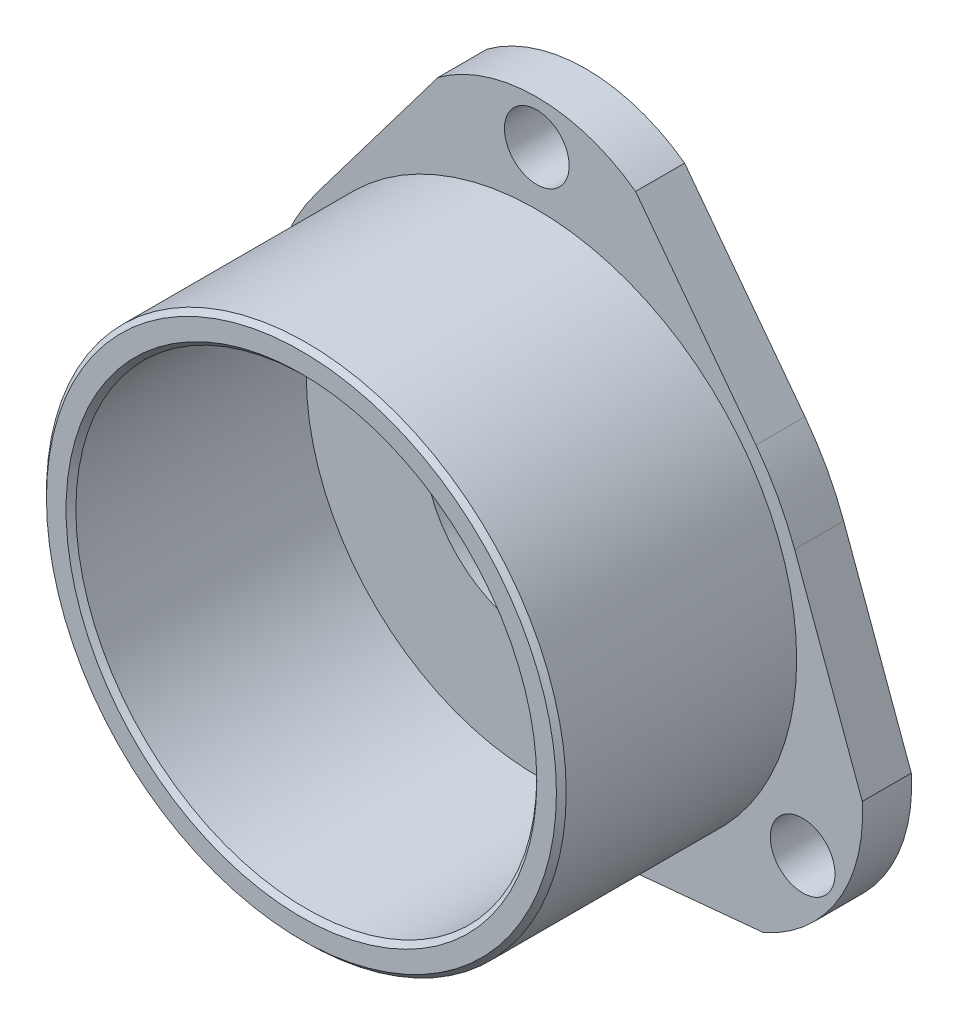
ISO-10303-21;
HEADER;
FILE_DESCRIPTION(('STEP AP214'),'2;1');
FILE_NAME('part.step','',(''),(''),'','','');
FILE_SCHEMA(('AUTOMOTIVE_DESIGN { 1 0 10303 214 1 1 1 1 }'));
ENDSEC;
DATA;
#1=APPLICATION_CONTEXT('core data for automotive mechanical design processes');
#2=APPLICATION_PROTOCOL_DEFINITION('international standard','automotive_design',2000,#1);
#3=PRODUCT_CONTEXT('',#1,'mechanical');
#4=PRODUCT('Part','Part','',(#3));
#5=PRODUCT_RELATED_PRODUCT_CATEGORY('part','',(#4));
#6=PRODUCT_DEFINITION_FORMATION('','',#4);
#7=PRODUCT_DEFINITION_CONTEXT('part definition',#1,'design');
#8=PRODUCT_DEFINITION('design','',#6,#7);
#9=PRODUCT_DEFINITION_SHAPE('','',#8);
#10=(LENGTH_UNIT() NAMED_UNIT(*) SI_UNIT(.MILLI.,.METRE.));
#11=(NAMED_UNIT(*) PLANE_ANGLE_UNIT() SI_UNIT($,.RADIAN.));
#12=(NAMED_UNIT(*) SI_UNIT($,.STERADIAN.) SOLID_ANGLE_UNIT());
#13=UNCERTAINTY_MEASURE_WITH_UNIT(LENGTH_MEASURE(1.E-05),#10,'distance_accuracy_value','');
#14=(GEOMETRIC_REPRESENTATION_CONTEXT(3) GLOBAL_UNCERTAINTY_ASSIGNED_CONTEXT((#13)) GLOBAL_UNIT_ASSIGNED_CONTEXT((#10,
#11,#12)) REPRESENTATION_CONTEXT('',''));
#15=CARTESIAN_POINT('',(0.,0.,0.));
#16=DIRECTION('',(0.,0.,1.));
#17=DIRECTION('',(1.,0.,0.));
#18=AXIS2_PLACEMENT_3D('',#15,#16,#17);
#19=CARTESIAN_POINT('',(-2.79624893309726,-12.0048209399467,0.));
#20=DIRECTION('',(0.,0.,1.));
#21=DIRECTION('',(1.,0.,0.));
#22=AXIS2_PLACEMENT_3D('',#19,#20,#21);
#23=PLANE('',#22);
#24=CARTESIAN_POINT('',(-2.79624893309726,-12.0048209399467,0.));
#25=DIRECTION('',(0.,0.,-1.));
#26=DIRECTION('',(-1.,0.,0.));
#27=AXIS2_PLACEMENT_3D('',#24,#25,#26);
#28=CIRCLE('',#27,11.5);
#29=CARTESIAN_POINT('',(-14.2962489330973,-12.0048209399467,0.));
#30=VERTEX_POINT('',#29);
#31=EDGE_CURVE('E373',#30,#30,#28,.T.);
#32=ORIENTED_EDGE('',*,*,#31,.F.);
#33=EDGE_LOOP('',(#32));
#34=FACE_BOUND('',#33,.T.);
#35=CARTESIAN_POINT('',(-2.79624893309727,19.9951790600533,0.));
#36=DIRECTION('',(0.,0.,-1.));
#37=DIRECTION('',(-1.,0.,0.));
#38=AXIS2_PLACEMENT_3D('',#35,#36,#37);
#39=CIRCLE('',#38,3.325);
#40=CARTESIAN_POINT('',(-6.12124893309727,19.9951790600533,0.));
#41=VERTEX_POINT('',#40);
#42=EDGE_CURVE('E365',#41,#41,#39,.T.);
#43=ORIENTED_EDGE('',*,*,#42,.F.);
#44=EDGE_LOOP('',(#43));
#45=FACE_BOUND('',#44,.T.);
#46=CARTESIAN_POINT('',(-29.9071323565492,-29.0048209399467,0.));
#47=DIRECTION('',(0.,0.,-1.));
#48=DIRECTION('',(-1.,0.,0.));
#49=AXIS2_PLACEMENT_3D('',#46,#47,#48);
#50=CIRCLE('',#49,3.325);
#51=CARTESIAN_POINT('',(-33.2321323565492,-29.0048209399467,0.));
#52=VERTEX_POINT('',#51);
#53=EDGE_CURVE('E356',#52,#52,#50,.T.);
#54=ORIENTED_EDGE('',*,*,#53,.F.);
#55=EDGE_LOOP('',(#54));
#56=FACE_BOUND('',#55,.T.);
#57=CARTESIAN_POINT('',(-2.79624893309726,-12.0048209399467,0.));
#58=DIRECTION('',(0.,0.,1.));
#59=DIRECTION('',(1.,0.,0.));
#60=AXIS2_PLACEMENT_3D('',#57,#58,#59);
#61=CIRCLE('',#60,28.);
#62=CARTESIAN_POINT('',(-8.08106996657628,-39.5015601401518,0.));
#63=VERTEX_POINT('',#62);
#64=CARTESIAN_POINT('',(2.48857210038176,-39.5015601401518,0.));
#65=VERTEX_POINT('',#64);
#66=EDGE_CURVE('E158',#63,#65,#61,.T.);
#67=ORIENTED_EDGE('',*,*,#66,.F.);
#68=DIRECTION('',(0.995496459061339,-0.0947987341494403,0.));
#69=VECTOR('',#68,1.);
#70=CARTESIAN_POINT('',(-25.9121818617762,-37.8035462288459,0.));
#71=LINE('',#70,#69);
#72=CARTESIAN_POINT('',(-25.9121818617762,-37.8035462288459,0.));
#73=VERTEX_POINT('',#72);
#74=EDGE_CURVE('E100',#73,#63,#71,.T.);
#75=ORIENTED_EDGE('',*,*,#74,.F.);
#76=CARTESIAN_POINT('',(-19.0179562514684,-22.2642523827866,0.));
#77=DIRECTION('',(0.,0.,1.));
#78=DIRECTION('',(1.,0.,0.));
#79=AXIS2_PLACEMENT_3D('',#76,#77,#78);
#80=CIRCLE('',#79,17.);
#81=CARTESIAN_POINT('',(-35.9837995088466,-21.1871439545981,0.));
#82=VERTEX_POINT('',#81);
#83=EDGE_CURVE('E94',#82,#73,#80,.T.);
#84=ORIENTED_EDGE('',*,*,#83,.F.);
#85=DIRECTION('',(-0.344158525020842,-0.938911555821675,0.));
#86=VECTOR('',#85,1.);
#87=CARTESIAN_POINT('',(-29.0857724961042,-2.36838223936307,0.));
#88=LINE('',#87,#86);
#89=CARTESIAN_POINT('',(-29.0857724961042,-2.36838223936307,0.));
#90=VERTEX_POINT('',#89);
#91=EDGE_CURVE('E148',#90,#82,#88,.T.);
#92=ORIENTED_EDGE('',*,*,#91,.F.);
#93=CARTESIAN_POINT('',(-2.79624893309726,-12.0048209399467,0.));
#94=DIRECTION('',(0.,0.,1.));
#95=DIRECTION('',(1.,0.,0.));
#96=AXIS2_PLACEMENT_3D('',#93,#94,#95);
#97=CIRCLE('',#96,28.);
#98=CARTESIAN_POINT('',(-25.140840178429,4.86880469531752,0.));
#99=VERTEX_POINT('',#98);
#100=EDGE_CURVE('E176',#99,#90,#97,.T.);
#101=ORIENTED_EDGE('',*,*,#100,.F.);
#102=DIRECTION('',(-0.602629486973722,-0.798021115904704,0.));
#103=VECTOR('',#102,1.);
#104=CARTESIAN_POINT('',(-12.8678665801677,21.121066322171,0.));
#105=LINE('',#104,#103);
#106=CARTESIAN_POINT('',(-12.8678665801677,21.121066322171,0.));
#107=VERTEX_POINT('',#106);
#108=EDGE_CURVE('E174',#107,#99,#105,.T.);
#109=ORIENTED_EDGE('',*,*,#108,.F.);
#110=CARTESIAN_POINT('',(-2.79624893309726,7.42571974126185,0.));
#111=DIRECTION('',(0.,0.,1.));
#112=DIRECTION('',(1.,0.,0.));
#113=AXIS2_PLACEMENT_3D('',#110,#111,#112);
#114=CIRCLE('',#113,17.);
#115=CARTESIAN_POINT('',(7.27536871397319,21.121066322171,0.));
#116=VERTEX_POINT('',#115);
#117=EDGE_CURVE('E172',#116,#107,#114,.T.);
#118=ORIENTED_EDGE('',*,*,#117,.F.);
#119=DIRECTION('',(-0.602629486973723,0.798021115904703,0.));
#120=VECTOR('',#119,1.);
#121=CARTESIAN_POINT('',(19.5483423122344,4.86880469531755,0.));
#122=LINE('',#121,#120);
#123=CARTESIAN_POINT('',(19.5483423122344,4.86880469531755,0.));
#124=VERTEX_POINT('',#123);
#125=EDGE_CURVE('E170',#124,#116,#122,.T.);
#126=ORIENTED_EDGE('',*,*,#125,.F.);
#127=CARTESIAN_POINT('',(-2.79624893309726,-12.0048209399467,0.));
#128=DIRECTION('',(0.,0.,1.));
#129=DIRECTION('',(1.,0.,0.));
#130=AXIS2_PLACEMENT_3D('',#127,#128,#129);
#131=CIRCLE('',#130,28.);
#132=CARTESIAN_POINT('',(23.4932746299096,-2.36838223936311,0.));
#133=VERTEX_POINT('',#132);
#134=EDGE_CURVE('E168',#133,#124,#131,.T.);
#135=ORIENTED_EDGE('',*,*,#134,.F.);
#136=DIRECTION('',(-0.344158525020843,0.938911555821675,0.));
#137=VECTOR('',#136,1.);
#138=CARTESIAN_POINT('',(30.3913016426521,-21.187143954598,0.));
#139=LINE('',#138,#137);
#140=CARTESIAN_POINT('',(30.3913016426521,-21.187143954598,0.));
#141=VERTEX_POINT('',#140);
#142=EDGE_CURVE('E166',#141,#133,#139,.T.);
#143=ORIENTED_EDGE('',*,*,#142,.F.);
#144=CARTESIAN_POINT('',(13.4254583852739,-22.2642523827866,0.));
#145=DIRECTION('',(0.,0.,1.));
#146=DIRECTION('',(1.,0.,0.));
#147=AXIS2_PLACEMENT_3D('',#144,#145,#146);
#148=CIRCLE('',#147,17.);
#149=CARTESIAN_POINT('',(20.3196839955817,-37.8035462288459,0.));
#150=VERTEX_POINT('',#149);
#151=EDGE_CURVE('E164',#150,#141,#148,.T.);
#152=ORIENTED_EDGE('',*,*,#151,.F.);
#153=DIRECTION('',(0.995496459061339,0.0947987341494402,0.));
#154=VECTOR('',#153,1.);
#155=CARTESIAN_POINT('',(2.48857210038176,-39.5015601401518,0.));
#156=LINE('',#155,#154);
#157=EDGE_CURVE('E161',#65,#150,#156,.T.);
#158=ORIENTED_EDGE('',*,*,#157,.F.);
#159=EDGE_LOOP('',(#67,#75,#84,#92,#101,#109,#118,#126,#135,#143,#152,#158));
#160=FACE_BOUND('',#159,.T.);
#161=CARTESIAN_POINT('',(24.3146344903546,-29.0048209399467,0.));
#162=DIRECTION('',(0.,0.,-1.));
#163=DIRECTION('',(-1.,0.,0.));
#164=AXIS2_PLACEMENT_3D('',#161,#162,#163);
#165=CIRCLE('',#164,3.325);
#166=CARTESIAN_POINT('',(20.9896344903547,-29.0048209399467,0.));
#167=VERTEX_POINT('',#166);
#168=EDGE_CURVE('E347',#167,#167,#165,.T.);
#169=ORIENTED_EDGE('',*,*,#168,.F.);
#170=EDGE_LOOP('',(#169));
#171=FACE_BOUND('',#170,.T.);
#172=ADVANCED_FACE('F35',(#34,#45,#56,#160,#171),#23,.F.);
#173=CARTESIAN_POINT('',(-2.79624893309726,-12.0048209399467,5.));
#174=DIRECTION('',(0.,0.,-1.));
#175=DIRECTION('',(-1.,0.,0.));
#176=AXIS2_PLACEMENT_3D('',#173,#174,#175);
#177=CYLINDRICAL_SURFACE('',#176,28.);
#178=ORIENTED_EDGE('',*,*,#66,.T.);
#179=DIRECTION('',(0.,0.,-1.));
#180=VECTOR('',#179,1.);
#181=CARTESIAN_POINT('',(2.48857210038176,-39.5015601401518,5.));
#182=LINE('',#181,#180);
#183=CARTESIAN_POINT('',(2.48857210038176,-39.5015601401518,5.));
#184=VERTEX_POINT('',#183);
#185=EDGE_CURVE('E206',#184,#65,#182,.T.);
#186=ORIENTED_EDGE('',*,*,#185,.F.);
#187=CARTESIAN_POINT('',(-2.79624893309726,-12.0048209399467,5.));
#188=DIRECTION('',(0.,0.,1.));
#189=DIRECTION('',(1.,0.,0.));
#190=AXIS2_PLACEMENT_3D('',#187,#188,#189);
#191=CIRCLE('',#190,28.);
#192=CARTESIAN_POINT('',(-8.08106996657628,-39.5015601401518,5.));
#193=VERTEX_POINT('',#192);
#194=EDGE_CURVE('E181',#193,#184,#191,.T.);
#195=ORIENTED_EDGE('',*,*,#194,.F.);
#196=DIRECTION('',(0.,0.,-1.));
#197=VECTOR('',#196,1.);
#198=CARTESIAN_POINT('',(-8.08106996657628,-39.5015601401518,5.));
#199=LINE('',#198,#197);
#200=EDGE_CURVE('E154',#193,#63,#199,.T.);
#201=ORIENTED_EDGE('',*,*,#200,.T.);
#202=EDGE_LOOP('',(#178,#186,#195,#201));
#203=FACE_BOUND('',#202,.T.);
#204=ADVANCED_FACE('F252',(#203),#177,.T.);
#205=CARTESIAN_POINT('',(2.48857210038176,-39.5015601401518,5.));
#206=DIRECTION('',(-0.0947987341494402,0.995496459061339,0.));
#207=DIRECTION('',(-0.995496459061339,-0.0947987341494402,0.));
#208=AXIS2_PLACEMENT_3D('',#205,#206,#207);
#209=PLANE('',#208);
#210=ORIENTED_EDGE('',*,*,#157,.T.);
#211=DIRECTION('',(0.,0.,-1.));
#212=VECTOR('',#211,1.);
#213=CARTESIAN_POINT('',(20.3196839955817,-37.8035462288459,5.));
#214=LINE('',#213,#212);
#215=CARTESIAN_POINT('',(20.3196839955817,-37.8035462288459,5.));
#216=VERTEX_POINT('',#215);
#217=EDGE_CURVE('E203',#216,#150,#214,.T.);
#218=ORIENTED_EDGE('',*,*,#217,.F.);
#219=DIRECTION('',(0.995496459061339,0.0947987341494402,0.));
#220=VECTOR('',#219,1.);
#221=CARTESIAN_POINT('',(2.48857210038176,-39.5015601401518,5.));
#222=LINE('',#221,#220);
#223=EDGE_CURVE('E109',#184,#216,#222,.T.);
#224=ORIENTED_EDGE('',*,*,#223,.F.);
#225=ORIENTED_EDGE('',*,*,#185,.T.);
#226=EDGE_LOOP('',(#210,#218,#224,#225));
#227=FACE_BOUND('',#226,.T.);
#228=ADVANCED_FACE('F257',(#227),#209,.F.);
#229=CARTESIAN_POINT('',(13.4254583852739,-22.2642523827866,5.));
#230=DIRECTION('',(0.,0.,-1.));
#231=DIRECTION('',(-1.,0.,0.));
#232=AXIS2_PLACEMENT_3D('',#229,#230,#231);
#233=CYLINDRICAL_SURFACE('',#232,17.);
#234=ORIENTED_EDGE('',*,*,#151,.T.);
#235=DIRECTION('',(0.,0.,-1.));
#236=VECTOR('',#235,1.);
#237=CARTESIAN_POINT('',(30.3913016426521,-21.187143954598,5.));
#238=LINE('',#237,#236);
#239=CARTESIAN_POINT('',(30.3913016426521,-21.187143954598,5.));
#240=VERTEX_POINT('',#239);
#241=EDGE_CURVE('E200',#240,#141,#238,.T.);
#242=ORIENTED_EDGE('',*,*,#241,.F.);
#243=CARTESIAN_POINT('',(13.4254583852739,-22.2642523827866,5.));
#244=DIRECTION('',(0.,0.,1.));
#245=DIRECTION('',(1.,0.,0.));
#246=AXIS2_PLACEMENT_3D('',#243,#244,#245);
#247=CIRCLE('',#246,17.);
#248=EDGE_CURVE('E311',#216,#240,#247,.T.);
#249=ORIENTED_EDGE('',*,*,#248,.F.);
#250=ORIENTED_EDGE('',*,*,#217,.T.);
#251=EDGE_LOOP('',(#234,#242,#249,#250));
#252=FACE_BOUND('',#251,.T.);
#253=ADVANCED_FACE('F292',(#252),#233,.T.);
#254=CARTESIAN_POINT('',(30.3913016426521,-21.187143954598,5.));
#255=DIRECTION('',(-0.938911555821675,-0.344158525020843,0.));
#256=DIRECTION('',(0.344158525020843,-0.938911555821675,0.));
#257=AXIS2_PLACEMENT_3D('',#254,#255,#256);
#258=PLANE('',#257);
#259=ORIENTED_EDGE('',*,*,#142,.T.);
#260=DIRECTION('',(0.,0.,-1.));
#261=VECTOR('',#260,1.);
#262=CARTESIAN_POINT('',(23.4932746299096,-2.36838223936311,5.));
#263=LINE('',#262,#261);
#264=CARTESIAN_POINT('',(23.4932746299096,-2.36838223936311,5.));
#265=VERTEX_POINT('',#264);
#266=EDGE_CURVE('E197',#265,#133,#263,.T.);
#267=ORIENTED_EDGE('',*,*,#266,.F.);
#268=DIRECTION('',(-0.344158525020843,0.938911555821675,0.));
#269=VECTOR('',#268,1.);
#270=CARTESIAN_POINT('',(30.3913016426521,-21.187143954598,5.));
#271=LINE('',#270,#269);
#272=EDGE_CURVE('E323',#240,#265,#271,.T.);
#273=ORIENTED_EDGE('',*,*,#272,.F.);
#274=ORIENTED_EDGE('',*,*,#241,.T.);
#275=EDGE_LOOP('',(#259,#267,#273,#274));
#276=FACE_BOUND('',#275,.T.);
#277=ADVANCED_FACE('F288',(#276),#258,.F.);
#278=CARTESIAN_POINT('',(-2.79624893309726,-12.0048209399467,5.));
#279=DIRECTION('',(0.,0.,-1.));
#280=DIRECTION('',(-1.,0.,0.));
#281=AXIS2_PLACEMENT_3D('',#278,#279,#280);
#282=CYLINDRICAL_SURFACE('',#281,28.);
#283=ORIENTED_EDGE('',*,*,#134,.T.);
#284=DIRECTION('',(0.,0.,-1.));
#285=VECTOR('',#284,1.);
#286=CARTESIAN_POINT('',(19.5483423122344,4.86880469531755,5.));
#287=LINE('',#286,#285);
#288=CARTESIAN_POINT('',(19.5483423122344,4.86880469531755,5.));
#289=VERTEX_POINT('',#288);
#290=EDGE_CURVE('E194',#289,#124,#287,.T.);
#291=ORIENTED_EDGE('',*,*,#290,.F.);
#292=CARTESIAN_POINT('',(-2.79624893309726,-12.0048209399467,5.));
#293=DIRECTION('',(0.,0.,1.));
#294=DIRECTION('',(1.,0.,0.));
#295=AXIS2_PLACEMENT_3D('',#292,#293,#294);
#296=CIRCLE('',#295,28.);
#297=EDGE_CURVE('E320',#265,#289,#296,.T.);
#298=ORIENTED_EDGE('',*,*,#297,.F.);
#299=ORIENTED_EDGE('',*,*,#266,.T.);
#300=EDGE_LOOP('',(#283,#291,#298,#299));
#301=FACE_BOUND('',#300,.T.);
#302=ADVANCED_FACE('F284',(#301),#282,.T.);
#303=CARTESIAN_POINT('',(19.5483423122344,4.86880469531755,5.));
#304=DIRECTION('',(-0.798021115904703,-0.602629486973723,0.));
#305=DIRECTION('',(0.602629486973723,-0.798021115904703,0.));
#306=AXIS2_PLACEMENT_3D('',#303,#304,#305);
#307=PLANE('',#306);
#308=ORIENTED_EDGE('',*,*,#125,.T.);
#309=DIRECTION('',(0.,0.,-1.));
#310=VECTOR('',#309,1.);
#311=CARTESIAN_POINT('',(7.27536871397319,21.121066322171,5.));
#312=LINE('',#311,#310);
#313=CARTESIAN_POINT('',(7.27536871397319,21.121066322171,5.));
#314=VERTEX_POINT('',#313);
#315=EDGE_CURVE('E191',#314,#116,#312,.T.);
#316=ORIENTED_EDGE('',*,*,#315,.F.);
#317=DIRECTION('',(-0.602629486973723,0.798021115904703,0.));
#318=VECTOR('',#317,1.);
#319=CARTESIAN_POINT('',(19.5483423122344,4.86880469531755,5.));
#320=LINE('',#319,#318);
#321=EDGE_CURVE('E322',#289,#314,#320,.T.);
#322=ORIENTED_EDGE('',*,*,#321,.F.);
#323=ORIENTED_EDGE('',*,*,#290,.T.);
#324=EDGE_LOOP('',(#308,#316,#322,#323));
#325=FACE_BOUND('',#324,.T.);
#326=ADVANCED_FACE('F280',(#325),#307,.F.);
#327=CARTESIAN_POINT('',(-2.79624893309726,7.42571974126185,5.));
#328=DIRECTION('',(0.,0.,-1.));
#329=DIRECTION('',(-1.,0.,0.));
#330=AXIS2_PLACEMENT_3D('',#327,#328,#329);
#331=CYLINDRICAL_SURFACE('',#330,17.);
#332=ORIENTED_EDGE('',*,*,#117,.T.);
#333=DIRECTION('',(0.,0.,-1.));
#334=VECTOR('',#333,1.);
#335=CARTESIAN_POINT('',(-12.8678665801677,21.121066322171,5.));
#336=LINE('',#335,#334);
#337=CARTESIAN_POINT('',(-12.8678665801677,21.121066322171,5.));
#338=VERTEX_POINT('',#337);
#339=EDGE_CURVE('E188',#338,#107,#336,.T.);
#340=ORIENTED_EDGE('',*,*,#339,.F.);
#341=CARTESIAN_POINT('',(-2.79624893309726,7.42571974126185,5.));
#342=DIRECTION('',(0.,0.,1.));
#343=DIRECTION('',(1.,0.,0.));
#344=AXIS2_PLACEMENT_3D('',#341,#342,#343);
#345=CIRCLE('',#344,17.);
#346=EDGE_CURVE('E325',#314,#338,#345,.T.);
#347=ORIENTED_EDGE('',*,*,#346,.F.);
#348=ORIENTED_EDGE('',*,*,#315,.T.);
#349=EDGE_LOOP('',(#332,#340,#347,#348));
#350=FACE_BOUND('',#349,.T.);
#351=ADVANCED_FACE('F276',(#350),#331,.T.);
#352=CARTESIAN_POINT('',(-12.8678665801677,21.121066322171,5.));
#353=DIRECTION('',(0.798021115904704,-0.602629486973722,0.));
#354=DIRECTION('',(0.602629486973722,0.798021115904704,0.));
#355=AXIS2_PLACEMENT_3D('',#352,#353,#354);
#356=PLANE('',#355);
#357=ORIENTED_EDGE('',*,*,#108,.T.);
#358=DIRECTION('',(0.,0.,-1.));
#359=VECTOR('',#358,1.);
#360=CARTESIAN_POINT('',(-25.140840178429,4.86880469531752,5.));
#361=LINE('',#360,#359);
#362=CARTESIAN_POINT('',(-25.140840178429,4.86880469531752,5.));
#363=VERTEX_POINT('',#362);
#364=EDGE_CURVE('E185',#363,#99,#361,.T.);
#365=ORIENTED_EDGE('',*,*,#364,.F.);
#366=DIRECTION('',(-0.602629486973722,-0.798021115904704,0.));
#367=VECTOR('',#366,1.);
#368=CARTESIAN_POINT('',(-12.8678665801677,21.121066322171,5.));
#369=LINE('',#368,#367);
#370=EDGE_CURVE('E331',#338,#363,#369,.T.);
#371=ORIENTED_EDGE('',*,*,#370,.F.);
#372=ORIENTED_EDGE('',*,*,#339,.T.);
#373=EDGE_LOOP('',(#357,#365,#371,#372));
#374=FACE_BOUND('',#373,.T.);
#375=ADVANCED_FACE('F272',(#374),#356,.F.);
#376=CARTESIAN_POINT('',(-2.79624893309726,-12.0048209399467,5.));
#377=DIRECTION('',(0.,0.,-1.));
#378=DIRECTION('',(-1.,0.,0.));
#379=AXIS2_PLACEMENT_3D('',#376,#377,#378);
#380=CYLINDRICAL_SURFACE('',#379,28.);
#381=ORIENTED_EDGE('',*,*,#100,.T.);
#382=DIRECTION('',(0.,0.,-1.));
#383=VECTOR('',#382,1.);
#384=CARTESIAN_POINT('',(-29.0857724961042,-2.36838223936307,5.));
#385=LINE('',#384,#383);
#386=CARTESIAN_POINT('',(-29.0857724961042,-2.36838223936307,5.));
#387=VERTEX_POINT('',#386);
#388=EDGE_CURVE('E149',#387,#90,#385,.T.);
#389=ORIENTED_EDGE('',*,*,#388,.F.);
#390=CARTESIAN_POINT('',(-2.79624893309726,-12.0048209399467,5.));
#391=DIRECTION('',(0.,0.,1.));
#392=DIRECTION('',(1.,0.,0.));
#393=AXIS2_PLACEMENT_3D('',#390,#391,#392);
#394=CIRCLE('',#393,28.);
#395=EDGE_CURVE('E140',#363,#387,#394,.T.);
#396=ORIENTED_EDGE('',*,*,#395,.F.);
#397=ORIENTED_EDGE('',*,*,#364,.T.);
#398=EDGE_LOOP('',(#381,#389,#396,#397));
#399=FACE_BOUND('',#398,.T.);
#400=ADVANCED_FACE('F269',(#399),#380,.T.);
#401=CARTESIAN_POINT('',(-29.0857724961042,-2.36838223936307,5.));
#402=DIRECTION('',(0.938911555821675,-0.344158525020842,0.));
#403=DIRECTION('',(0.344158525020842,0.938911555821675,0.));
#404=AXIS2_PLACEMENT_3D('',#401,#402,#403);
#405=PLANE('',#404);
#406=ORIENTED_EDGE('',*,*,#91,.T.);
#407=DIRECTION('',(0.,0.,-1.));
#408=VECTOR('',#407,1.);
#409=CARTESIAN_POINT('',(-35.9837995088466,-21.1871439545981,5.));
#410=LINE('',#409,#408);
#411=CARTESIAN_POINT('',(-35.9837995088466,-21.1871439545981,5.));
#412=VERTEX_POINT('',#411);
#413=EDGE_CURVE('E145',#412,#82,#410,.T.);
#414=ORIENTED_EDGE('',*,*,#413,.F.);
#415=DIRECTION('',(-0.344158525020842,-0.938911555821675,0.));
#416=VECTOR('',#415,1.);
#417=CARTESIAN_POINT('',(-29.0857724961042,-2.36838223936307,5.));
#418=LINE('',#417,#416);
#419=EDGE_CURVE('E134',#387,#412,#418,.T.);
#420=ORIENTED_EDGE('',*,*,#419,.F.);
#421=ORIENTED_EDGE('',*,*,#388,.T.);
#422=EDGE_LOOP('',(#406,#414,#420,#421));
#423=FACE_BOUND('',#422,.T.);
#424=ADVANCED_FACE('F146',(#423),#405,.F.);
#425=CARTESIAN_POINT('',(-19.0179562514684,-22.2642523827866,5.));
#426=DIRECTION('',(0.,0.,-1.));
#427=DIRECTION('',(-1.,0.,0.));
#428=AXIS2_PLACEMENT_3D('',#425,#426,#427);
#429=CYLINDRICAL_SURFACE('',#428,17.);
#430=ORIENTED_EDGE('',*,*,#83,.T.);
#431=DIRECTION('',(0.,0.,-1.));
#432=VECTOR('',#431,1.);
#433=CARTESIAN_POINT('',(-25.9121818617762,-37.8035462288459,5.));
#434=LINE('',#433,#432);
#435=CARTESIAN_POINT('',(-25.9121818617762,-37.8035462288459,5.));
#436=VERTEX_POINT('',#435);
#437=EDGE_CURVE('E150',#436,#73,#434,.T.);
#438=ORIENTED_EDGE('',*,*,#437,.F.);
#439=CARTESIAN_POINT('',(-19.0179562514684,-22.2642523827866,5.));
#440=DIRECTION('',(0.,0.,1.));
#441=DIRECTION('',(1.,0.,0.));
#442=AXIS2_PLACEMENT_3D('',#439,#440,#441);
#443=CIRCLE('',#442,17.);
#444=EDGE_CURVE('E138',#412,#436,#443,.T.);
#445=ORIENTED_EDGE('',*,*,#444,.F.);
#446=ORIENTED_EDGE('',*,*,#413,.T.);
#447=EDGE_LOOP('',(#430,#438,#445,#446));
#448=FACE_BOUND('',#447,.T.);
#449=ADVANCED_FACE('F152',(#448),#429,.T.);
#450=CARTESIAN_POINT('',(-25.9121818617762,-37.8035462288459,5.));
#451=DIRECTION('',(0.0947987341494403,0.995496459061339,0.));
#452=DIRECTION('',(-0.995496459061339,0.0947987341494403,0.));
#453=AXIS2_PLACEMENT_3D('',#450,#451,#452);
#454=PLANE('',#453);
#455=ORIENTED_EDGE('',*,*,#74,.T.);
#456=ORIENTED_EDGE('',*,*,#200,.F.);
#457=DIRECTION('',(0.995496459061339,-0.0947987341494403,0.));
#458=VECTOR('',#457,1.);
#459=CARTESIAN_POINT('',(-25.9121818617762,-37.8035462288459,5.));
#460=LINE('',#459,#458);
#461=EDGE_CURVE('E53',#436,#193,#460,.T.);
#462=ORIENTED_EDGE('',*,*,#461,.F.);
#463=ORIENTED_EDGE('',*,*,#437,.T.);
#464=EDGE_LOOP('',(#455,#456,#462,#463));
#465=FACE_BOUND('',#464,.T.);
#466=ADVANCED_FACE('F249',(#465),#454,.F.);
#467=CARTESIAN_POINT('',(-2.79624893309726,-12.0048209399467,5.));
#468=DIRECTION('',(0.,0.,1.));
#469=DIRECTION('',(1.,0.,0.));
#470=AXIS2_PLACEMENT_3D('',#467,#468,#469);
#471=PLANE('',#470);
#472=CARTESIAN_POINT('',(-2.79624893309726,-12.0048209399467,5.));
#473=DIRECTION('',(0.,0.,1.));
#474=DIRECTION('',(1.,0.,0.));
#475=AXIS2_PLACEMENT_3D('',#472,#473,#474);
#476=CIRCLE('',#475,26.5);
#477=CARTESIAN_POINT('',(23.7037510669027,-12.0048209399467,5.));
#478=VERTEX_POINT('',#477);
#479=EDGE_CURVE('E368',#478,#478,#476,.T.);
#480=ORIENTED_EDGE('',*,*,#479,.F.);
#481=EDGE_LOOP('',(#480));
#482=FACE_BOUND('',#481,.T.);
#483=CARTESIAN_POINT('',(-2.79624893309727,19.9951790600533,5.));
#484=DIRECTION('',(0.,0.,-1.));
#485=DIRECTION('',(-1.,0.,0.));
#486=AXIS2_PLACEMENT_3D('',#483,#484,#485);
#487=CIRCLE('',#486,3.3);
#488=CARTESIAN_POINT('',(-6.09624893309726,19.9951790600533,5.));
#489=VERTEX_POINT('',#488);
#490=EDGE_CURVE('E359',#489,#489,#487,.T.);
#491=ORIENTED_EDGE('',*,*,#490,.T.);
#492=EDGE_LOOP('',(#491));
#493=FACE_BOUND('',#492,.T.);
#494=CARTESIAN_POINT('',(-29.9071323565492,-29.0048209399467,5.));
#495=DIRECTION('',(0.,0.,-1.));
#496=DIRECTION('',(-1.,0.,0.));
#497=AXIS2_PLACEMENT_3D('',#494,#495,#496);
#498=CIRCLE('',#497,3.3);
#499=CARTESIAN_POINT('',(-33.2071323565492,-29.0048209399467,5.));
#500=VERTEX_POINT('',#499);
#501=EDGE_CURVE('E350',#500,#500,#498,.T.);
#502=ORIENTED_EDGE('',*,*,#501,.T.);
#503=EDGE_LOOP('',(#502));
#504=FACE_BOUND('',#503,.T.);
#505=CARTESIAN_POINT('',(24.3146344903546,-29.0048209399467,5.));
#506=DIRECTION('',(0.,0.,-1.));
#507=DIRECTION('',(-1.,0.,0.));
#508=AXIS2_PLACEMENT_3D('',#505,#506,#507);
#509=CIRCLE('',#508,3.3);
#510=CARTESIAN_POINT('',(21.0146344903547,-29.0048209399467,5.));
#511=VERTEX_POINT('',#510);
#512=EDGE_CURVE('E162',#511,#511,#509,.T.);
#513=ORIENTED_EDGE('',*,*,#512,.T.);
#514=EDGE_LOOP('',(#513));
#515=FACE_BOUND('',#514,.T.);
#516=ORIENTED_EDGE('',*,*,#194,.T.);
#517=ORIENTED_EDGE('',*,*,#223,.T.);
#518=ORIENTED_EDGE('',*,*,#248,.T.);
#519=ORIENTED_EDGE('',*,*,#272,.T.);
#520=ORIENTED_EDGE('',*,*,#297,.T.);
#521=ORIENTED_EDGE('',*,*,#321,.T.);
#522=ORIENTED_EDGE('',*,*,#346,.T.);
#523=ORIENTED_EDGE('',*,*,#370,.T.);
#524=ORIENTED_EDGE('',*,*,#395,.T.);
#525=ORIENTED_EDGE('',*,*,#419,.T.);
#526=ORIENTED_EDGE('',*,*,#444,.T.);
#527=ORIENTED_EDGE('',*,*,#461,.T.);
#528=EDGE_LOOP('',(#516,#517,#518,#519,#520,#521,#522,#523,#524,#525,#526,#527));
#529=FACE_BOUND('',#528,.T.);
#530=ADVANCED_FACE('F136',(#482,#493,#504,#515,#529),#471,.T.);
#531=CARTESIAN_POINT('',(24.3146344903546,-29.0048209399467,0.));
#532=DIRECTION('',(0.,0.,-1.));
#533=DIRECTION('',(-1.,0.,0.));
#534=AXIS2_PLACEMENT_3D('',#531,#532,#533);
#535=CYLINDRICAL_SURFACE('',#534,3.29999999999999);
#536=ORIENTED_EDGE('',*,*,#512,.F.);
#537=EDGE_LOOP('',(#536));
#538=FACE_BOUND('',#537,.T.);
#539=CARTESIAN_POINT('',(24.3146344903546,-29.0048209399467,0.0249999999999972));
#540=DIRECTION('',(0.,0.,-1.));
#541=DIRECTION('',(-1.,0.,0.));
#542=AXIS2_PLACEMENT_3D('',#539,#540,#541);
#543=CIRCLE('',#542,3.29999999999999);
#544=CARTESIAN_POINT('',(21.0146344903547,-29.0048209399467,0.0249999999999972));
#545=VERTEX_POINT('',#544);
#546=EDGE_CURVE('E344',#545,#545,#543,.T.);
#547=ORIENTED_EDGE('',*,*,#546,.T.);
#548=EDGE_LOOP('',(#547));
#549=FACE_BOUND('',#548,.T.);
#550=ADVANCED_FACE('F248',(#538,#549),#535,.F.);
#551=CARTESIAN_POINT('',(24.3146344903546,-29.0048209399467,0.));
#552=DIRECTION('',(0.,0.,-1.));
#553=DIRECTION('',(-1.,0.,0.));
#554=AXIS2_PLACEMENT_3D('',#551,#552,#553);
#555=CONICAL_SURFACE('',#554,3.325,0.785398163397691);
#556=ORIENTED_EDGE('',*,*,#546,.F.);
#557=EDGE_LOOP('',(#556));
#558=FACE_BOUND('',#557,.T.);
#559=ORIENTED_EDGE('',*,*,#168,.T.);
#560=EDGE_LOOP('',(#559));
#561=FACE_BOUND('',#560,.T.);
#562=ADVANCED_FACE('F388',(#558,#561),#555,.F.);
#563=CARTESIAN_POINT('',(-29.9071323565492,-29.0048209399467,0.));
#564=DIRECTION('',(0.,0.,-1.));
#565=DIRECTION('',(-1.,0.,0.));
#566=AXIS2_PLACEMENT_3D('',#563,#564,#565);
#567=CYLINDRICAL_SURFACE('',#566,3.29999999999999);
#568=ORIENTED_EDGE('',*,*,#501,.F.);
#569=EDGE_LOOP('',(#568));
#570=FACE_BOUND('',#569,.T.);
#571=CARTESIAN_POINT('',(-29.9071323565492,-29.0048209399467,0.0249999999999972));
#572=DIRECTION('',(0.,0.,-1.));
#573=DIRECTION('',(-1.,0.,0.));
#574=AXIS2_PLACEMENT_3D('',#571,#572,#573);
#575=CIRCLE('',#574,3.29999999999999);
#576=CARTESIAN_POINT('',(-33.2071323565492,-29.0048209399467,0.0249999999999972));
#577=VERTEX_POINT('',#576);
#578=EDGE_CURVE('E353',#577,#577,#575,.T.);
#579=ORIENTED_EDGE('',*,*,#578,.T.);
#580=EDGE_LOOP('',(#579));
#581=FACE_BOUND('',#580,.T.);
#582=ADVANCED_FACE('F393',(#570,#581),#567,.F.);
#583=CARTESIAN_POINT('',(-29.9071323565492,-29.0048209399467,0.));
#584=DIRECTION('',(0.,0.,-1.));
#585=DIRECTION('',(-1.,0.,0.));
#586=AXIS2_PLACEMENT_3D('',#583,#584,#585);
#587=CONICAL_SURFACE('',#586,3.325,0.785398163397691);
#588=ORIENTED_EDGE('',*,*,#578,.F.);
#589=EDGE_LOOP('',(#588));
#590=FACE_BOUND('',#589,.T.);
#591=ORIENTED_EDGE('',*,*,#53,.T.);
#592=EDGE_LOOP('',(#591));
#593=FACE_BOUND('',#592,.T.);
#594=ADVANCED_FACE('F399',(#590,#593),#587,.F.);
#595=CARTESIAN_POINT('',(-2.79624893309727,19.9951790600533,0.));
#596=DIRECTION('',(0.,0.,-1.));
#597=DIRECTION('',(-1.,0.,0.));
#598=AXIS2_PLACEMENT_3D('',#595,#596,#597);
#599=CYLINDRICAL_SURFACE('',#598,3.29999999999999);
#600=ORIENTED_EDGE('',*,*,#490,.F.);
#601=EDGE_LOOP('',(#600));
#602=FACE_BOUND('',#601,.T.);
#603=CARTESIAN_POINT('',(-2.79624893309727,19.9951790600533,0.0249999999999972));
#604=DIRECTION('',(0.,0.,-1.));
#605=DIRECTION('',(-1.,0.,0.));
#606=AXIS2_PLACEMENT_3D('',#603,#604,#605);
#607=CIRCLE('',#606,3.29999999999999);
#608=CARTESIAN_POINT('',(-6.09624893309725,19.9951790600533,0.0249999999999972));
#609=VERTEX_POINT('',#608);
#610=EDGE_CURVE('E362',#609,#609,#607,.T.);
#611=ORIENTED_EDGE('',*,*,#610,.T.);
#612=EDGE_LOOP('',(#611));
#613=FACE_BOUND('',#612,.T.);
#614=ADVANCED_FACE('F405',(#602,#613),#599,.F.);
#615=CARTESIAN_POINT('',(-2.79624893309727,19.9951790600533,0.));
#616=DIRECTION('',(0.,0.,-1.));
#617=DIRECTION('',(-1.,0.,0.));
#618=AXIS2_PLACEMENT_3D('',#615,#616,#617);
#619=CONICAL_SURFACE('',#618,3.325,0.785398163397726);
#620=ORIENTED_EDGE('',*,*,#610,.F.);
#621=EDGE_LOOP('',(#620));
#622=FACE_BOUND('',#621,.T.);
#623=ORIENTED_EDGE('',*,*,#42,.T.);
#624=EDGE_LOOP('',(#623));
#625=FACE_BOUND('',#624,.T.);
#626=ADVANCED_FACE('F409',(#622,#625),#619,.F.);
#627=CARTESIAN_POINT('',(-2.79624893309726,-12.0048209399467,29.));
#628=DIRECTION('',(0.,0.,1.));
#629=DIRECTION('',(1.,0.,0.));
#630=AXIS2_PLACEMENT_3D('',#627,#628,#629);
#631=PLANE('',#630);
#632=CARTESIAN_POINT('',(-2.79624893309726,-12.0048209399467,29.));
#633=DIRECTION('',(0.,0.,1.));
#634=DIRECTION('',(1.,0.,0.));
#635=AXIS2_PLACEMENT_3D('',#632,#633,#634);
#636=CIRCLE('',#635,24.);
#637=CARTESIAN_POINT('',(21.2037510669027,-12.0048209399467,29.));
#638=VERTEX_POINT('',#637);
#639=EDGE_CURVE('E45',#638,#638,#636,.F.);
#640=ORIENTED_EDGE('',*,*,#639,.T.);
#641=EDGE_LOOP('',(#640));
#642=FACE_BOUND('',#641,.T.);
#643=CARTESIAN_POINT('',(-2.79624893309726,-12.0048209399467,29.));
#644=DIRECTION('',(0.,0.,1.));
#645=DIRECTION('',(1.,0.,0.));
#646=AXIS2_PLACEMENT_3D('',#643,#644,#645);
#647=CIRCLE('',#646,26.);
#648=CARTESIAN_POINT('',(23.2037510669027,-12.0048209399467,29.));
#649=VERTEX_POINT('',#648);
#650=EDGE_CURVE('E214',#649,#649,#647,.T.);
#651=ORIENTED_EDGE('',*,*,#650,.T.);
#652=EDGE_LOOP('',(#651));
#653=FACE_BOUND('',#652,.T.);
#654=ADVANCED_FACE('F219',(#642,#653),#631,.T.);
#655=CARTESIAN_POINT('',(-2.79624893309726,-12.0048209399467,29.));
#656=DIRECTION('',(0.,0.,-1.));
#657=DIRECTION('',(-1.,0.,0.));
#658=AXIS2_PLACEMENT_3D('',#655,#656,#657);
#659=CYLINDRICAL_SURFACE('',#658,26.5);
#660=CARTESIAN_POINT('',(-2.79624893309726,-12.0048209399467,28.5));
#661=DIRECTION('',(0.,0.,1.));
#662=DIRECTION('',(1.,0.,0.));
#663=AXIS2_PLACEMENT_3D('',#660,#661,#662);
#664=CIRCLE('',#663,26.5);
#665=CARTESIAN_POINT('',(23.7037510669027,-12.0048209399467,28.5));
#666=VERTEX_POINT('',#665);
#667=EDGE_CURVE('E11',#666,#666,#664,.F.);
#668=ORIENTED_EDGE('',*,*,#667,.T.);
#669=EDGE_LOOP('',(#668));
#670=FACE_BOUND('',#669,.T.);
#671=ORIENTED_EDGE('',*,*,#479,.T.);
#672=EDGE_LOOP('',(#671));
#673=FACE_BOUND('',#672,.T.);
#674=ADVANCED_FACE('F232',(#670,#673),#659,.T.);
#675=CARTESIAN_POINT('',(-2.79624893309726,-12.0048209399467,29.));
#676=DIRECTION('',(0.,0.,-1.));
#677=DIRECTION('',(-1.,0.,0.));
#678=AXIS2_PLACEMENT_3D('',#675,#676,#677);
#679=CYLINDRICAL_SURFACE('',#678,23.5);
#680=CARTESIAN_POINT('',(-2.79624893309726,-12.0048209399467,28.5));
#681=DIRECTION('',(0.,0.,1.));
#682=DIRECTION('',(1.,0.,0.));
#683=AXIS2_PLACEMENT_3D('',#680,#681,#682);
#684=CIRCLE('',#683,23.5);
#685=CARTESIAN_POINT('',(20.7037510669027,-12.0048209399467,28.5));
#686=VERTEX_POINT('',#685);
#687=EDGE_CURVE('E211',#686,#686,#684,.T.);
#688=ORIENTED_EDGE('',*,*,#687,.T.);
#689=EDGE_LOOP('',(#688));
#690=FACE_BOUND('',#689,.T.);
#691=CARTESIAN_POINT('',(-2.79624893309726,-12.0048209399467,5.));
#692=DIRECTION('',(0.,0.,1.));
#693=DIRECTION('',(1.,0.,0.));
#694=AXIS2_PLACEMENT_3D('',#691,#692,#693);
#695=CIRCLE('',#694,23.5);
#696=CARTESIAN_POINT('',(20.7037510669027,-12.0048209399467,5.));
#697=VERTEX_POINT('',#696);
#698=EDGE_CURVE('E208',#697,#697,#695,.F.);
#699=ORIENTED_EDGE('',*,*,#698,.T.);
#700=EDGE_LOOP('',(#699));
#701=FACE_BOUND('',#700,.T.);
#702=ADVANCED_FACE('F228',(#690,#701),#679,.F.);
#703=CARTESIAN_POINT('',(-2.79624893309726,-12.0048209399467,5.));
#704=DIRECTION('',(0.,0.,1.));
#705=DIRECTION('',(1.,0.,0.));
#706=AXIS2_PLACEMENT_3D('',#703,#704,#705);
#707=CIRCLE('',#706,11.5);
#708=CARTESIAN_POINT('',(8.70375106690274,-12.0048209399467,5.));
#709=VERTEX_POINT('',#708);
#710=EDGE_CURVE('E371',#709,#709,#707,.F.);
#711=ORIENTED_EDGE('',*,*,#710,.T.);
#712=EDGE_LOOP('',(#711));
#713=FACE_BOUND('',#712,.T.);
#714=ORIENTED_EDGE('',*,*,#698,.F.);
#715=EDGE_LOOP('',(#714));
#716=FACE_BOUND('',#715,.T.);
#717=ADVANCED_FACE('F231',(#713,#716),#471,.T.);
#718=CARTESIAN_POINT('',(-2.79624893309726,-12.0048209399467,37.5269119345812));
#719=DIRECTION('',(0.,0.,-1.));
#720=DIRECTION('',(-1.,0.,0.));
#721=AXIS2_PLACEMENT_3D('',#718,#719,#720);
#722=CYLINDRICAL_SURFACE('',#721,11.5);
#723=ORIENTED_EDGE('',*,*,#31,.T.);
#724=EDGE_LOOP('',(#723));
#725=FACE_BOUND('',#724,.T.);
#726=ORIENTED_EDGE('',*,*,#710,.F.);
#727=EDGE_LOOP('',(#726));
#728=FACE_BOUND('',#727,.T.);
#729=ADVANCED_FACE('F225',(#725,#728),#722,.F.);
#730=CARTESIAN_POINT('',(-2.79624893309726,-12.0048209399467,28.5));
#731=DIRECTION('',(0.,0.,1.));
#732=DIRECTION('',(1.,0.,0.));
#733=AXIS2_PLACEMENT_3D('',#730,#731,#732);
#734=CONICAL_SURFACE('',#733,23.5,0.785398163397452);
#735=ORIENTED_EDGE('',*,*,#639,.F.);
#736=EDGE_LOOP('',(#735));
#737=FACE_BOUND('',#736,.T.);
#738=ORIENTED_EDGE('',*,*,#687,.F.);
#739=EDGE_LOOP('',(#738));
#740=FACE_BOUND('',#739,.T.);
#741=ADVANCED_FACE('F222',(#737,#740),#734,.F.);
#742=CARTESIAN_POINT('',(-2.79624893309726,-12.0048209399467,29.));
#743=DIRECTION('',(0.,0.,-1.));
#744=DIRECTION('',(-1.,0.,0.));
#745=AXIS2_PLACEMENT_3D('',#742,#743,#744);
#746=CONICAL_SURFACE('',#745,26.,0.785398163397438);
#747=ORIENTED_EDGE('',*,*,#667,.F.);
#748=EDGE_LOOP('',(#747));
#749=FACE_BOUND('',#748,.T.);
#750=ORIENTED_EDGE('',*,*,#650,.F.);
#751=EDGE_LOOP('',(#750));
#752=FACE_BOUND('',#751,.T.);
#753=ADVANCED_FACE('F38',(#749,#752),#746,.T.);
#754=CLOSED_SHELL('',(#172,#204,#228,#253,#277,#302,#326,#351,#375,#400,#424,#449,#466,#530,
#550,#562,#582,#594,#614,#626,#654,#674,#702,#717,#729,#741,#753));
#755=MANIFOLD_SOLID_BREP('B2',#754);
#756=ADVANCED_BREP_SHAPE_REPRESENTATION('',(#18,#755),#14);
#757=SHAPE_DEFINITION_REPRESENTATION(#9,#756);
ENDSEC;
END-ISO-10303-21;
